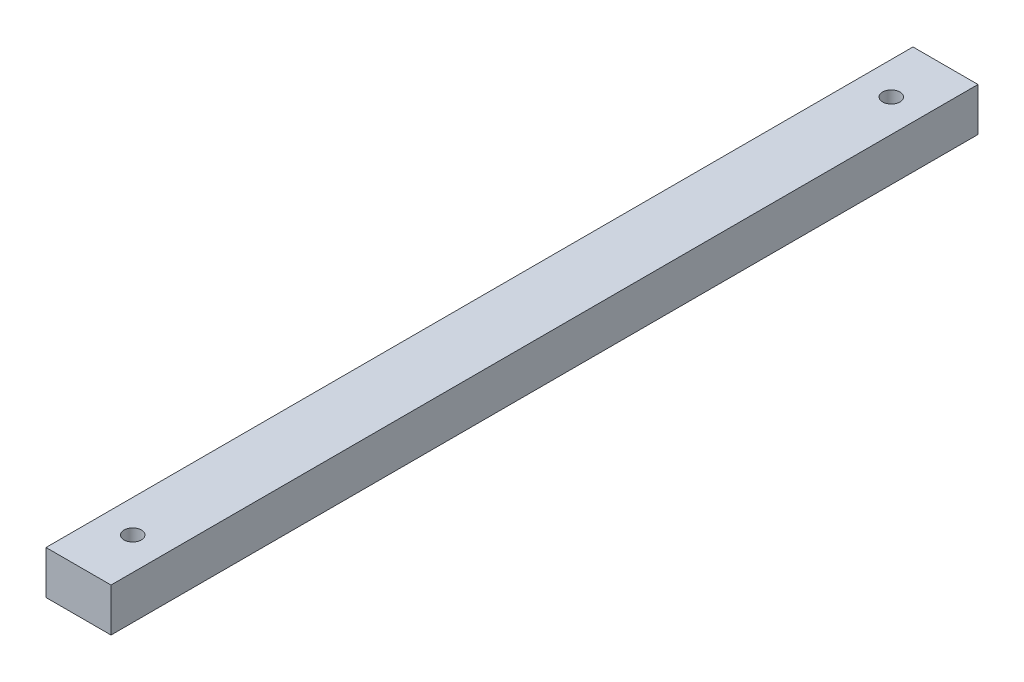
ISO-10303-21;
HEADER;
FILE_DESCRIPTION(('STEP AP214'),'2;1');
FILE_NAME('part.step','',(''),(''),'','','');
FILE_SCHEMA(('AUTOMOTIVE_DESIGN { 1 0 10303 214 1 1 1 1 }'));
ENDSEC;
DATA;
#1=APPLICATION_CONTEXT('core data for automotive mechanical design processes');
#2=APPLICATION_PROTOCOL_DEFINITION('international standard','automotive_design',2000,#1);
#3=PRODUCT_CONTEXT('',#1,'mechanical');
#4=PRODUCT('Part','Part','',(#3));
#5=PRODUCT_RELATED_PRODUCT_CATEGORY('part','',(#4));
#6=PRODUCT_DEFINITION_FORMATION('','',#4);
#7=PRODUCT_DEFINITION_CONTEXT('part definition',#1,'design');
#8=PRODUCT_DEFINITION('design','',#6,#7);
#9=PRODUCT_DEFINITION_SHAPE('','',#8);
#10=(LENGTH_UNIT() NAMED_UNIT(*) SI_UNIT(.MILLI.,.METRE.));
#11=(NAMED_UNIT(*) PLANE_ANGLE_UNIT() SI_UNIT($,.RADIAN.));
#12=(NAMED_UNIT(*) SI_UNIT($,.STERADIAN.) SOLID_ANGLE_UNIT());
#13=UNCERTAINTY_MEASURE_WITH_UNIT(LENGTH_MEASURE(1.E-05),#10,'distance_accuracy_value','');
#14=(GEOMETRIC_REPRESENTATION_CONTEXT(3) GLOBAL_UNCERTAINTY_ASSIGNED_CONTEXT((#13)) GLOBAL_UNIT_ASSIGNED_CONTEXT((#10,
#11,#12)) REPRESENTATION_CONTEXT('',''));
#15=CARTESIAN_POINT('',(0.,0.,0.));
#16=DIRECTION('',(0.,0.,1.));
#17=DIRECTION('',(1.,0.,0.));
#18=AXIS2_PLACEMENT_3D('',#15,#16,#17);
#19=CARTESIAN_POINT('',(-15.,10.,400.));
#20=DIRECTION('',(1.,0.,0.));
#21=DIRECTION('',(0.,1.,0.));
#22=AXIS2_PLACEMENT_3D('',#19,#20,#21);
#23=PLANE('',#22);
#24=DIRECTION('',(0.,-1.,0.));
#25=VECTOR('',#24,1.);
#26=CARTESIAN_POINT('',(-15.,10.,0.));
#27=LINE('',#26,#25);
#28=CARTESIAN_POINT('',(-15.,10.,0.));
#29=VERTEX_POINT('',#28);
#30=CARTESIAN_POINT('',(-15.,-10.,0.));
#31=VERTEX_POINT('',#30);
#32=EDGE_CURVE('E95',#29,#31,#27,.T.);
#33=ORIENTED_EDGE('',*,*,#32,.T.);
#34=DIRECTION('',(0.,0.,-1.));
#35=VECTOR('',#34,1.);
#36=CARTESIAN_POINT('',(-15.,-10.,400.));
#37=LINE('',#36,#35);
#38=CARTESIAN_POINT('',(-15.,-10.,400.));
#39=VERTEX_POINT('',#38);
#40=EDGE_CURVE('E11',#39,#31,#37,.T.);
#41=ORIENTED_EDGE('',*,*,#40,.F.);
#42=DIRECTION('',(0.,-1.,0.));
#43=VECTOR('',#42,1.);
#44=CARTESIAN_POINT('',(-15.,10.,400.));
#45=LINE('',#44,#43);
#46=CARTESIAN_POINT('',(-15.,10.,400.));
#47=VERTEX_POINT('',#46);
#48=EDGE_CURVE('E83',#47,#39,#45,.T.);
#49=ORIENTED_EDGE('',*,*,#48,.F.);
#50=DIRECTION('',(0.,0.,-1.));
#51=VECTOR('',#50,1.);
#52=CARTESIAN_POINT('',(-15.,10.,400.));
#53=LINE('',#52,#51);
#54=EDGE_CURVE('E91',#47,#29,#53,.T.);
#55=ORIENTED_EDGE('',*,*,#54,.T.);
#56=EDGE_LOOP('',(#33,#41,#49,#55));
#57=FACE_BOUND('',#56,.T.);
#58=ADVANCED_FACE('F32',(#57),#23,.F.);
#59=CARTESIAN_POINT('',(15.,-10.,400.));
#60=DIRECTION('',(0.,1.,0.));
#61=DIRECTION('',(-1.,0.,0.));
#62=AXIS2_PLACEMENT_3D('',#59,#60,#61);
#63=PLANE('',#62);
#64=CARTESIAN_POINT('',(0.,-10.,25.));
#65=DIRECTION('',(0.,1.,0.));
#66=DIRECTION('',(-1.,0.,0.));
#67=AXIS2_PLACEMENT_3D('',#64,#65,#66);
#68=CIRCLE('',#67,4.);
#69=CARTESIAN_POINT('',(-4.,-10.,25.));
#70=VERTEX_POINT('',#69);
#71=EDGE_CURVE('E114',#70,#70,#68,.T.);
#72=ORIENTED_EDGE('',*,*,#71,.T.);
#73=EDGE_LOOP('',(#72));
#74=FACE_BOUND('',#73,.T.);
#75=CARTESIAN_POINT('',(0.,-10.,375.));
#76=DIRECTION('',(0.,1.,0.));
#77=DIRECTION('',(-1.,0.,0.));
#78=AXIS2_PLACEMENT_3D('',#75,#76,#77);
#79=CIRCLE('',#78,4.);
#80=CARTESIAN_POINT('',(-4.,-10.,375.));
#81=VERTEX_POINT('',#80);
#82=EDGE_CURVE('E98',#81,#81,#79,.T.);
#83=ORIENTED_EDGE('',*,*,#82,.T.);
#84=EDGE_LOOP('',(#83));
#85=FACE_BOUND('',#84,.T.);
#86=DIRECTION('',(1.,0.,0.));
#87=VECTOR('',#86,1.);
#88=CARTESIAN_POINT('',(15.,-10.,0.));
#89=LINE('',#88,#87);
#90=CARTESIAN_POINT('',(15.,-10.,0.));
#91=VERTEX_POINT('',#90);
#92=EDGE_CURVE('E87',#31,#91,#89,.T.);
#93=ORIENTED_EDGE('',*,*,#92,.T.);
#94=DIRECTION('',(0.,0.,-1.));
#95=VECTOR('',#94,1.);
#96=CARTESIAN_POINT('',(15.,-10.,400.));
#97=LINE('',#96,#95);
#98=CARTESIAN_POINT('',(15.,-10.,400.));
#99=VERTEX_POINT('',#98);
#100=EDGE_CURVE('E40',#99,#91,#97,.T.);
#101=ORIENTED_EDGE('',*,*,#100,.F.);
#102=DIRECTION('',(1.,0.,0.));
#103=VECTOR('',#102,1.);
#104=CARTESIAN_POINT('',(15.,-10.,400.));
#105=LINE('',#104,#103);
#106=EDGE_CURVE('E78',#39,#99,#105,.T.);
#107=ORIENTED_EDGE('',*,*,#106,.F.);
#108=ORIENTED_EDGE('',*,*,#40,.T.);
#109=EDGE_LOOP('',(#93,#101,#107,#108));
#110=FACE_BOUND('',#109,.T.);
#111=ADVANCED_FACE('F86',(#74,#85,#110),#63,.F.);
#112=CARTESIAN_POINT('',(15.,10.,400.));
#113=DIRECTION('',(-1.,0.,0.));
#114=DIRECTION('',(0.,-1.,0.));
#115=AXIS2_PLACEMENT_3D('',#112,#113,#114);
#116=PLANE('',#115);
#117=DIRECTION('',(0.,1.,0.));
#118=VECTOR('',#117,1.);
#119=CARTESIAN_POINT('',(15.,10.,0.));
#120=LINE('',#119,#118);
#121=CARTESIAN_POINT('',(15.,10.,0.));
#122=VERTEX_POINT('',#121);
#123=EDGE_CURVE('E65',#91,#122,#120,.T.);
#124=ORIENTED_EDGE('',*,*,#123,.T.);
#125=DIRECTION('',(0.,0.,-1.));
#126=VECTOR('',#125,1.);
#127=CARTESIAN_POINT('',(15.,10.,400.));
#128=LINE('',#127,#126);
#129=CARTESIAN_POINT('',(15.,10.,400.));
#130=VERTEX_POINT('',#129);
#131=EDGE_CURVE('E88',#130,#122,#128,.T.);
#132=ORIENTED_EDGE('',*,*,#131,.F.);
#133=DIRECTION('',(0.,1.,0.));
#134=VECTOR('',#133,1.);
#135=CARTESIAN_POINT('',(15.,10.,400.));
#136=LINE('',#135,#134);
#137=EDGE_CURVE('E81',#99,#130,#136,.T.);
#138=ORIENTED_EDGE('',*,*,#137,.F.);
#139=ORIENTED_EDGE('',*,*,#100,.T.);
#140=EDGE_LOOP('',(#124,#132,#138,#139));
#141=FACE_BOUND('',#140,.T.);
#142=ADVANCED_FACE('F89',(#141),#116,.F.);
#143=CARTESIAN_POINT('',(15.,10.,400.));
#144=DIRECTION('',(0.,-1.,0.));
#145=DIRECTION('',(1.,0.,0.));
#146=AXIS2_PLACEMENT_3D('',#143,#144,#145);
#147=PLANE('',#146);
#148=CARTESIAN_POINT('',(0.,10.,25.));
#149=DIRECTION('',(0.,1.,0.));
#150=DIRECTION('',(-1.,0.,0.));
#151=AXIS2_PLACEMENT_3D('',#148,#149,#150);
#152=CIRCLE('',#151,4.);
#153=CARTESIAN_POINT('',(-4.,10.,25.));
#154=VERTEX_POINT('',#153);
#155=EDGE_CURVE('E117',#154,#154,#152,.T.);
#156=ORIENTED_EDGE('',*,*,#155,.F.);
#157=EDGE_LOOP('',(#156));
#158=FACE_BOUND('',#157,.T.);
#159=CARTESIAN_POINT('',(0.,10.,375.));
#160=DIRECTION('',(0.,1.,0.));
#161=DIRECTION('',(-1.,0.,0.));
#162=AXIS2_PLACEMENT_3D('',#159,#160,#161);
#163=CIRCLE('',#162,4.);
#164=CARTESIAN_POINT('',(-4.,10.,375.));
#165=VERTEX_POINT('',#164);
#166=EDGE_CURVE('E111',#165,#165,#163,.T.);
#167=ORIENTED_EDGE('',*,*,#166,.F.);
#168=EDGE_LOOP('',(#167));
#169=FACE_BOUND('',#168,.T.);
#170=DIRECTION('',(-1.,0.,0.));
#171=VECTOR('',#170,1.);
#172=CARTESIAN_POINT('',(15.,10.,0.));
#173=LINE('',#172,#171);
#174=EDGE_CURVE('E71',#122,#29,#173,.T.);
#175=ORIENTED_EDGE('',*,*,#174,.T.);
#176=ORIENTED_EDGE('',*,*,#54,.F.);
#177=DIRECTION('',(-1.,0.,0.));
#178=VECTOR('',#177,1.);
#179=CARTESIAN_POINT('',(15.,10.,400.));
#180=LINE('',#179,#178);
#181=EDGE_CURVE('E48',#130,#47,#180,.T.);
#182=ORIENTED_EDGE('',*,*,#181,.F.);
#183=ORIENTED_EDGE('',*,*,#131,.T.);
#184=EDGE_LOOP('',(#175,#176,#182,#183));
#185=FACE_BOUND('',#184,.T.);
#186=ADVANCED_FACE('F103',(#158,#169,#185),#147,.F.);
#187=CARTESIAN_POINT('',(0.,0.,400.));
#188=DIRECTION('',(0.,0.,-1.));
#189=DIRECTION('',(-1.,0.,0.));
#190=AXIS2_PLACEMENT_3D('',#187,#188,#189);
#191=PLANE('',#190);
#192=ORIENTED_EDGE('',*,*,#48,.T.);
#193=ORIENTED_EDGE('',*,*,#106,.T.);
#194=ORIENTED_EDGE('',*,*,#137,.T.);
#195=ORIENTED_EDGE('',*,*,#181,.T.);
#196=EDGE_LOOP('',(#192,#193,#194,#195));
#197=FACE_BOUND('',#196,.T.);
#198=ADVANCED_FACE('F79',(#197),#191,.F.);
#199=CARTESIAN_POINT('',(0.,0.,0.));
#200=DIRECTION('',(0.,0.,-1.));
#201=DIRECTION('',(-1.,0.,0.));
#202=AXIS2_PLACEMENT_3D('',#199,#200,#201);
#203=PLANE('',#202);
#204=ORIENTED_EDGE('',*,*,#32,.F.);
#205=ORIENTED_EDGE('',*,*,#174,.F.);
#206=ORIENTED_EDGE('',*,*,#123,.F.);
#207=ORIENTED_EDGE('',*,*,#92,.F.);
#208=EDGE_LOOP('',(#204,#205,#206,#207));
#209=FACE_BOUND('',#208,.T.);
#210=ADVANCED_FACE('F106',(#209),#203,.T.);
#211=CARTESIAN_POINT('',(0.,-390.,375.));
#212=DIRECTION('',(0.,1.,0.));
#213=DIRECTION('',(-1.,0.,0.));
#214=AXIS2_PLACEMENT_3D('',#211,#212,#213);
#215=CYLINDRICAL_SURFACE('',#214,4.);
#216=ORIENTED_EDGE('',*,*,#166,.T.);
#217=EDGE_LOOP('',(#216));
#218=FACE_BOUND('',#217,.T.);
#219=ORIENTED_EDGE('',*,*,#82,.F.);
#220=EDGE_LOOP('',(#219));
#221=FACE_BOUND('',#220,.T.);
#222=ADVANCED_FACE('F129',(#218,#221),#215,.F.);
#223=CARTESIAN_POINT('',(0.,-390.,25.));
#224=DIRECTION('',(0.,1.,0.));
#225=DIRECTION('',(-1.,0.,0.));
#226=AXIS2_PLACEMENT_3D('',#223,#224,#225);
#227=CYLINDRICAL_SURFACE('',#226,4.);
#228=ORIENTED_EDGE('',*,*,#155,.T.);
#229=EDGE_LOOP('',(#228));
#230=FACE_BOUND('',#229,.T.);
#231=ORIENTED_EDGE('',*,*,#71,.F.);
#232=EDGE_LOOP('',(#231));
#233=FACE_BOUND('',#232,.T.);
#234=ADVANCED_FACE('F121',(#230,#233),#227,.F.);
#235=CLOSED_SHELL('',(#58,#111,#142,#186,#198,#210,#222,#234));
#236=MANIFOLD_SOLID_BREP('B2',#235);
#237=ADVANCED_BREP_SHAPE_REPRESENTATION('',(#18,#236),#14);
#238=SHAPE_DEFINITION_REPRESENTATION(#9,#237);
ENDSEC;
END-ISO-10303-21;
